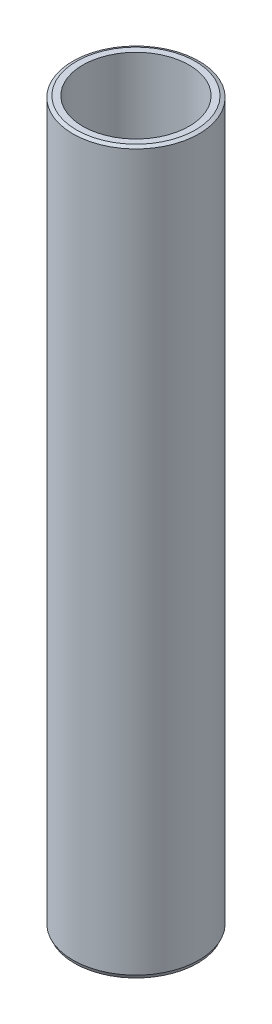
ISO-10303-21;
HEADER;
FILE_DESCRIPTION(('STEP AP214'),'2;1');
FILE_NAME('part.step','',(''),(''),'','','');
FILE_SCHEMA(('AUTOMOTIVE_DESIGN { 1 0 10303 214 1 1 1 1 }'));
ENDSEC;
DATA;
#1=APPLICATION_CONTEXT('core data for automotive mechanical design processes');
#2=APPLICATION_PROTOCOL_DEFINITION('international standard','automotive_design',2000,#1);
#3=PRODUCT_CONTEXT('',#1,'mechanical');
#4=PRODUCT('Part','Part','',(#3));
#5=PRODUCT_RELATED_PRODUCT_CATEGORY('part','',(#4));
#6=PRODUCT_DEFINITION_FORMATION('','',#4);
#7=PRODUCT_DEFINITION_CONTEXT('part definition',#1,'design');
#8=PRODUCT_DEFINITION('design','',#6,#7);
#9=PRODUCT_DEFINITION_SHAPE('','',#8);
#10=(LENGTH_UNIT() NAMED_UNIT(*) SI_UNIT(.MILLI.,.METRE.));
#11=(NAMED_UNIT(*) PLANE_ANGLE_UNIT() SI_UNIT($,.RADIAN.));
#12=(NAMED_UNIT(*) SI_UNIT($,.STERADIAN.) SOLID_ANGLE_UNIT());
#13=UNCERTAINTY_MEASURE_WITH_UNIT(LENGTH_MEASURE(1.E-05),#10,'distance_accuracy_value','');
#14=(GEOMETRIC_REPRESENTATION_CONTEXT(3) GLOBAL_UNCERTAINTY_ASSIGNED_CONTEXT((#13)) GLOBAL_UNIT_ASSIGNED_CONTEXT((#10,
#11,#12)) REPRESENTATION_CONTEXT('',''));
#15=CARTESIAN_POINT('',(0.,0.,0.));
#16=DIRECTION('',(0.,0.,1.));
#17=DIRECTION('',(1.,0.,0.));
#18=AXIS2_PLACEMENT_3D('',#15,#16,#17);
#19=CARTESIAN_POINT('',(0.,600.,0.));
#20=DIRECTION('',(0.,-1.,0.));
#21=DIRECTION('',(0.,0.,-1.));
#22=AXIS2_PLACEMENT_3D('',#19,#20,#21);
#23=CYLINDRICAL_SURFACE('',#22,52.5);
#24=CARTESIAN_POINT('',(0.,598.674709636591,0.));
#25=DIRECTION('',(0.,1.,0.));
#26=DIRECTION('',(0.,0.,1.));
#27=AXIS2_PLACEMENT_3D('',#24,#25,#26);
#28=CIRCLE('',#27,52.5);
#29=CARTESIAN_POINT('',(0.,598.674709636591,52.5));
#30=VERTEX_POINT('',#29);
#31=EDGE_CURVE('E50',#30,#30,#28,.F.);
#32=ORIENTED_EDGE('',*,*,#31,.T.);
#33=EDGE_LOOP('',(#32));
#34=FACE_BOUND('',#33,.T.);
#35=CARTESIAN_POINT('',(0.,2.99266001298337,0.));
#36=DIRECTION('',(0.,1.,0.));
#37=DIRECTION('',(0.,0.,1.));
#38=AXIS2_PLACEMENT_3D('',#35,#36,#37);
#39=CIRCLE('',#38,52.5);
#40=CARTESIAN_POINT('',(0.,2.99266001298337,52.5));
#41=VERTEX_POINT('',#40);
#42=EDGE_CURVE('E51',#41,#41,#39,.T.);
#43=ORIENTED_EDGE('',*,*,#42,.T.);
#44=EDGE_LOOP('',(#43));
#45=FACE_BOUND('',#44,.T.);
#46=ADVANCED_FACE('F39',(#34,#45),#23,.T.);
#47=CARTESIAN_POINT('',(0.,600.,0.));
#48=DIRECTION('',(0.,1.,0.));
#49=DIRECTION('',(0.,0.,1.));
#50=AXIS2_PLACEMENT_3D('',#47,#48,#49);
#51=PLANE('',#50);
#52=CARTESIAN_POINT('',(0.,600.,0.));
#53=DIRECTION('',(0.,1.,0.));
#54=DIRECTION('',(0.,0.,1.));
#55=AXIS2_PLACEMENT_3D('',#52,#53,#54);
#56=CIRCLE('',#55,49.5073399870166);
#57=CARTESIAN_POINT('',(0.,600.,49.5073399870166));
#58=VERTEX_POINT('',#57);
#59=EDGE_CURVE('E54',#58,#58,#56,.T.);
#60=ORIENTED_EDGE('',*,*,#59,.T.);
#61=EDGE_LOOP('',(#60));
#62=FACE_BOUND('',#61,.T.);
#63=CARTESIAN_POINT('',(0.,600.,0.));
#64=DIRECTION('',(0.,1.,0.));
#65=DIRECTION('',(0.,0.,1.));
#66=AXIS2_PLACEMENT_3D('',#63,#64,#65);
#67=CIRCLE('',#66,44.2414186051656);
#68=CARTESIAN_POINT('',(0.,600.,44.2414186051656));
#69=VERTEX_POINT('',#68);
#70=EDGE_CURVE('E58',#69,#69,#67,.T.);
#71=ORIENTED_EDGE('',*,*,#70,.F.);
#72=EDGE_LOOP('',(#71));
#73=FACE_BOUND('',#72,.T.);
#74=ADVANCED_FACE('F69',(#62,#73),#51,.T.);
#75=CARTESIAN_POINT('',(0.,0.,0.));
#76=DIRECTION('',(0.,1.,0.));
#77=DIRECTION('',(0.,0.,1.));
#78=AXIS2_PLACEMENT_3D('',#75,#76,#77);
#79=PLANE('',#78);
#80=CARTESIAN_POINT('',(0.,0.,0.));
#81=DIRECTION('',(0.,1.,0.));
#82=DIRECTION('',(0.,0.,1.));
#83=AXIS2_PLACEMENT_3D('',#80,#81,#82);
#84=CIRCLE('',#83,51.1747096365914);
#85=CARTESIAN_POINT('',(0.,0.,51.1747096365914));
#86=VERTEX_POINT('',#85);
#87=EDGE_CURVE('E10',#86,#86,#84,.F.);
#88=ORIENTED_EDGE('',*,*,#87,.T.);
#89=EDGE_LOOP('',(#88));
#90=FACE_BOUND('',#89,.T.);
#91=CARTESIAN_POINT('',(0.,0.,0.));
#92=DIRECTION('',(0.,1.,0.));
#93=DIRECTION('',(0.,0.,1.));
#94=AXIS2_PLACEMENT_3D('',#91,#92,#93);
#95=CIRCLE('',#94,44.2414186051656);
#96=CARTESIAN_POINT('',(0.,0.,44.2414186051656));
#97=VERTEX_POINT('',#96);
#98=EDGE_CURVE('E63',#97,#97,#95,.T.);
#99=ORIENTED_EDGE('',*,*,#98,.T.);
#100=EDGE_LOOP('',(#99));
#101=FACE_BOUND('',#100,.T.);
#102=ADVANCED_FACE('F75',(#90,#101),#79,.F.);
#103=CARTESIAN_POINT('',(0.,600.,0.));
#104=DIRECTION('',(0.,-1.,0.));
#105=DIRECTION('',(0.,0.,-1.));
#106=AXIS2_PLACEMENT_3D('',#103,#104,#105);
#107=CYLINDRICAL_SURFACE('',#106,44.2414186051656);
#108=ORIENTED_EDGE('',*,*,#70,.T.);
#109=EDGE_LOOP('',(#108));
#110=FACE_BOUND('',#109,.T.);
#111=ORIENTED_EDGE('',*,*,#98,.F.);
#112=EDGE_LOOP('',(#111));
#113=FACE_BOUND('',#112,.T.);
#114=ADVANCED_FACE('F70',(#110,#113),#107,.F.);
#115=CARTESIAN_POINT('',(0.,600.,0.));
#116=DIRECTION('',(0.,-1.,0.));
#117=DIRECTION('',(0.,0.,-1.));
#118=AXIS2_PLACEMENT_3D('',#115,#116,#117);
#119=CONICAL_SURFACE('',#118,49.5073399870166,1.15390677680706);
#120=ORIENTED_EDGE('',*,*,#31,.F.);
#121=EDGE_LOOP('',(#120));
#122=FACE_BOUND('',#121,.T.);
#123=ORIENTED_EDGE('',*,*,#59,.F.);
#124=EDGE_LOOP('',(#123));
#125=FACE_BOUND('',#124,.T.);
#126=ADVANCED_FACE('F81',(#122,#125),#119,.T.);
#127=CARTESIAN_POINT('',(0.,2.99266001298337,0.));
#128=DIRECTION('',(0.,1.,0.));
#129=DIRECTION('',(0.,0.,1.));
#130=AXIS2_PLACEMENT_3D('',#127,#128,#129);
#131=CONICAL_SURFACE('',#130,52.5,0.416889549987807);
#132=ORIENTED_EDGE('',*,*,#87,.F.);
#133=EDGE_LOOP('',(#132));
#134=FACE_BOUND('',#133,.T.);
#135=ORIENTED_EDGE('',*,*,#42,.F.);
#136=EDGE_LOOP('',(#135));
#137=FACE_BOUND('',#136,.T.);
#138=ADVANCED_FACE('F45',(#134,#137),#131,.T.);
#139=CLOSED_SHELL('',(#46,#74,#102,#114,#126,#138));
#140=MANIFOLD_SOLID_BREP('B2',#139);
#141=ADVANCED_BREP_SHAPE_REPRESENTATION('',(#18,#140),#14);
#142=SHAPE_DEFINITION_REPRESENTATION(#9,#141);
ENDSEC;
END-ISO-10303-21;
